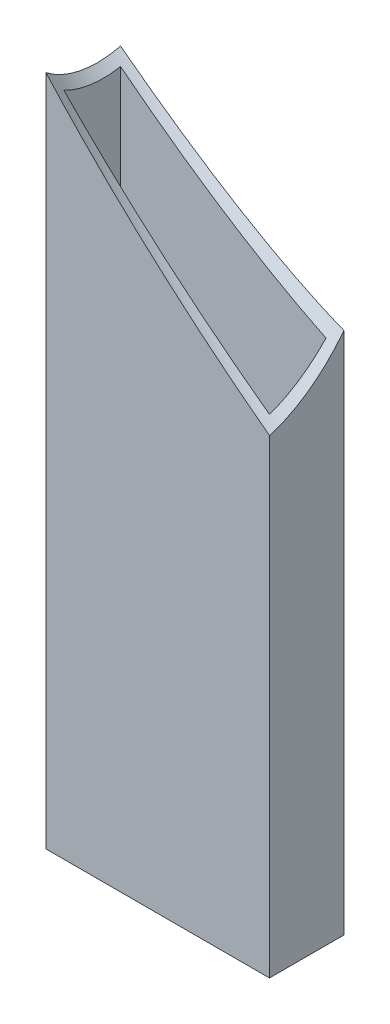
ISO-10303-21;
HEADER;
FILE_DESCRIPTION(('STEP AP214'),'2;1');
FILE_NAME('part.step','',(''),(''),'','','');
FILE_SCHEMA(('AUTOMOTIVE_DESIGN { 1 0 10303 214 1 1 1 1 }'));
ENDSEC;
DATA;
#1=APPLICATION_CONTEXT('core data for automotive mechanical design processes');
#2=APPLICATION_PROTOCOL_DEFINITION('international standard','automotive_design',2000,#1);
#3=PRODUCT_CONTEXT('',#1,'mechanical');
#4=PRODUCT('Part','Part','',(#3));
#5=PRODUCT_RELATED_PRODUCT_CATEGORY('part','',(#4));
#6=PRODUCT_DEFINITION_FORMATION('','',#4);
#7=PRODUCT_DEFINITION_CONTEXT('part definition',#1,'design');
#8=PRODUCT_DEFINITION('design','',#6,#7);
#9=PRODUCT_DEFINITION_SHAPE('','',#8);
#10=(LENGTH_UNIT() NAMED_UNIT(*) SI_UNIT(.MILLI.,.METRE.));
#11=(NAMED_UNIT(*) PLANE_ANGLE_UNIT() SI_UNIT($,.RADIAN.));
#12=(NAMED_UNIT(*) SI_UNIT($,.STERADIAN.) SOLID_ANGLE_UNIT());
#13=UNCERTAINTY_MEASURE_WITH_UNIT(LENGTH_MEASURE(1.E-05),#10,'distance_accuracy_value','');
#14=(GEOMETRIC_REPRESENTATION_CONTEXT(3) GLOBAL_UNCERTAINTY_ASSIGNED_CONTEXT((#13)) GLOBAL_UNIT_ASSIGNED_CONTEXT((#10,
#11,#12)) REPRESENTATION_CONTEXT('',''));
#15=CARTESIAN_POINT('',(0.,0.,0.));
#16=DIRECTION('',(0.,0.,1.));
#17=DIRECTION('',(1.,0.,0.));
#18=AXIS2_PLACEMENT_3D('',#15,#16,#17);
#19=CARTESIAN_POINT('',(0.,0.,0.));
#20=DIRECTION('',(0.,1.,0.));
#21=DIRECTION('',(0.,0.,1.));
#22=AXIS2_PLACEMENT_3D('',#19,#20,#21);
#23=PLANE('',#22);
#24=DIRECTION('',(0.,0.,1.));
#25=VECTOR('',#24,1.);
#26=CARTESIAN_POINT('',(-38.1,0.,-12.7));
#27=LINE('',#26,#25);
#28=CARTESIAN_POINT('',(-38.1,0.,-12.7));
#29=VERTEX_POINT('',#28);
#30=CARTESIAN_POINT('',(-38.1,0.,12.7));
#31=VERTEX_POINT('',#30);
#32=EDGE_CURVE('E125',#29,#31,#27,.T.);
#33=ORIENTED_EDGE('',*,*,#32,.F.);
#34=DIRECTION('',(-1.,0.,0.));
#35=VECTOR('',#34,1.);
#36=CARTESIAN_POINT('',(-38.1,0.,-12.7));
#37=LINE('',#36,#35);
#38=CARTESIAN_POINT('',(38.1,0.,-12.7));
#39=VERTEX_POINT('',#38);
#40=EDGE_CURVE('E134',#39,#29,#37,.T.);
#41=ORIENTED_EDGE('',*,*,#40,.F.);
#42=DIRECTION('',(0.,0.,-1.));
#43=VECTOR('',#42,1.);
#44=CARTESIAN_POINT('',(38.1,0.,-12.7));
#45=LINE('',#44,#43);
#46=CARTESIAN_POINT('',(38.1,0.,12.7));
#47=VERTEX_POINT('',#46);
#48=EDGE_CURVE('E131',#47,#39,#45,.T.);
#49=ORIENTED_EDGE('',*,*,#48,.F.);
#50=DIRECTION('',(1.,0.,0.));
#51=VECTOR('',#50,1.);
#52=CARTESIAN_POINT('',(-38.1,0.,12.7));
#53=LINE('',#52,#51);
#54=EDGE_CURVE('E128',#31,#47,#53,.T.);
#55=ORIENTED_EDGE('',*,*,#54,.F.);
#56=EDGE_LOOP('',(#33,#41,#49,#55));
#57=FACE_BOUND('',#56,.T.);
#58=DIRECTION('',(0.,0.,1.));
#59=VECTOR('',#58,1.);
#60=CARTESIAN_POINT('',(-35.052,0.,-9.65199999999999));
#61=LINE('',#60,#59);
#62=CARTESIAN_POINT('',(-35.052,0.,-9.65199999999999));
#63=VERTEX_POINT('',#62);
#64=CARTESIAN_POINT('',(-35.052,0.,9.652));
#65=VERTEX_POINT('',#64);
#66=EDGE_CURVE('E170',#63,#65,#61,.T.);
#67=ORIENTED_EDGE('',*,*,#66,.T.);
#68=DIRECTION('',(1.,0.,0.));
#69=VECTOR('',#68,1.);
#70=CARTESIAN_POINT('',(-35.052,0.,9.652));
#71=LINE('',#70,#69);
#72=CARTESIAN_POINT('',(35.052,0.,9.65199999999999));
#73=VERTEX_POINT('',#72);
#74=EDGE_CURVE('E173',#65,#73,#71,.T.);
#75=ORIENTED_EDGE('',*,*,#74,.T.);
#76=DIRECTION('',(0.,0.,-1.));
#77=VECTOR('',#76,1.);
#78=CARTESIAN_POINT('',(35.052,0.,-9.652));
#79=LINE('',#78,#77);
#80=CARTESIAN_POINT('',(35.052,0.,-9.652));
#81=VERTEX_POINT('',#80);
#82=EDGE_CURVE('E176',#73,#81,#79,.T.);
#83=ORIENTED_EDGE('',*,*,#82,.T.);
#84=DIRECTION('',(-1.,0.,0.));
#85=VECTOR('',#84,1.);
#86=CARTESIAN_POINT('',(-35.052,0.,-9.65199999999999));
#87=LINE('',#86,#85);
#88=EDGE_CURVE('E115',#81,#63,#87,.T.);
#89=ORIENTED_EDGE('',*,*,#88,.T.);
#90=EDGE_LOOP('',(#67,#75,#83,#89));
#91=FACE_BOUND('',#90,.T.);
#92=ADVANCED_FACE('F36',(#57,#91),#23,.F.);
#93=CARTESIAN_POINT('',(-38.1,241.091915260124,-12.7));
#94=DIRECTION('',(1.,0.,0.));
#95=DIRECTION('',(0.,0.,-1.));
#96=AXIS2_PLACEMENT_3D('',#93,#94,#95);
#97=PLANE('',#96);
#98=CARTESIAN_POINT('',(-38.1,273.413813543828,-13.4309935455485));
#99=DIRECTION('',(1.,0.,0.));
#100=DIRECTION('',(0.,0.923446362363606,-0.383727528120442));
#101=AXIS2_PLACEMENT_3D('',#98,#99,#100);
#102=ELLIPSE('',#101,51.7368987888011,38.1);
#103=CARTESIAN_POINT('',(-38.1,224.433507501644,-12.7));
#104=VERTEX_POINT('',#103);
#105=CARTESIAN_POINT('',(-38.1,229.251403372283,12.7));
#106=VERTEX_POINT('',#105);
#107=EDGE_CURVE('E157',#104,#106,#102,.F.);
#108=ORIENTED_EDGE('',*,*,#107,.F.);
#109=DIRECTION('',(0.,-1.,0.));
#110=VECTOR('',#109,1.);
#111=CARTESIAN_POINT('',(-38.1,241.091915260124,-12.7));
#112=LINE('',#111,#110);
#113=EDGE_CURVE('E137',#104,#29,#112,.T.);
#114=ORIENTED_EDGE('',*,*,#113,.T.);
#115=ORIENTED_EDGE('',*,*,#32,.T.);
#116=DIRECTION('',(0.,-1.,0.));
#117=VECTOR('',#116,1.);
#118=CARTESIAN_POINT('',(-38.1,241.091915260124,12.7));
#119=LINE('',#118,#117);
#120=EDGE_CURVE('E44',#106,#31,#119,.T.);
#121=ORIENTED_EDGE('',*,*,#120,.F.);
#122=EDGE_LOOP('',(#108,#114,#115,#121));
#123=FACE_BOUND('',#122,.T.);
#124=ADVANCED_FACE('F38',(#123),#97,.F.);
#125=CARTESIAN_POINT('',(-38.1,241.091915260124,12.7));
#126=DIRECTION('',(0.,0.,-1.));
#127=DIRECTION('',(-1.,0.,0.));
#128=AXIS2_PLACEMENT_3D('',#125,#126,#127);
#129=PLANE('',#128);
#130=CARTESIAN_POINT('',(36.0263742484161,210.529164499285,12.7));
#131=DIRECTION('',(0.,0.,-1.));
#132=DIRECTION('',(-0.76256219900897,0.646914903710375,0.));
#133=AXIS2_PLACEMENT_3D('',#130,#131,#132);
#134=ELLIPSE('',#133,146.763218757306,38.1);
#135=CARTESIAN_POINT('',(38.1,160.17860199527,12.7));
#136=VERTEX_POINT('',#135);
#137=EDGE_CURVE('E149',#106,#136,#134,.F.);
#138=ORIENTED_EDGE('',*,*,#137,.F.);
#139=ORIENTED_EDGE('',*,*,#120,.T.);
#140=ORIENTED_EDGE('',*,*,#54,.T.);
#141=DIRECTION('',(0.,-1.,0.));
#142=VECTOR('',#141,1.);
#143=CARTESIAN_POINT('',(38.1,241.091915260124,12.7));
#144=LINE('',#143,#142);
#145=EDGE_CURVE('E141',#136,#47,#144,.T.);
#146=ORIENTED_EDGE('',*,*,#145,.F.);
#147=EDGE_LOOP('',(#138,#139,#140,#146));
#148=FACE_BOUND('',#147,.T.);
#149=ADVANCED_FACE('F146',(#148),#129,.F.);
#150=CARTESIAN_POINT('',(38.1,241.091915260124,-12.7));
#151=DIRECTION('',(-1.,0.,0.));
#152=DIRECTION('',(0.,0.,1.));
#153=AXIS2_PLACEMENT_3D('',#150,#151,#152);
#154=PLANE('',#153);
#155=CARTESIAN_POINT('',(38.1,208.77001697642,13.4309935455487));
#156=DIRECTION('',(-1.,0.,0.));
#157=DIRECTION('',(0.,0.923446362363606,-0.383727528120442));
#158=AXIS2_PLACEMENT_3D('',#155,#156,#157);
#159=ELLIPSE('',#158,51.7368987888011,38.1);
#160=CARTESIAN_POINT('',(38.1,178.509384553323,-12.7));
#161=VERTEX_POINT('',#160);
#162=EDGE_CURVE('E51',#136,#161,#159,.F.);
#163=ORIENTED_EDGE('',*,*,#162,.F.);
#164=ORIENTED_EDGE('',*,*,#145,.T.);
#165=ORIENTED_EDGE('',*,*,#48,.T.);
#166=DIRECTION('',(0.,-1.,0.));
#167=VECTOR('',#166,1.);
#168=CARTESIAN_POINT('',(38.1,241.091915260124,-12.7));
#169=LINE('',#168,#167);
#170=EDGE_CURVE('E139',#161,#39,#169,.T.);
#171=ORIENTED_EDGE('',*,*,#170,.F.);
#172=EDGE_LOOP('',(#163,#164,#165,#171));
#173=FACE_BOUND('',#172,.T.);
#174=ADVANCED_FACE('F163',(#173),#154,.F.);
#175=CARTESIAN_POINT('',(-38.1,241.091915260124,-12.7));
#176=DIRECTION('',(0.,0.,1.));
#177=DIRECTION('',(1.,0.,0.));
#178=AXIS2_PLACEMENT_3D('',#175,#176,#177);
#179=PLANE('',#178);
#180=CARTESIAN_POINT('',(-36.0263742484167,271.654666020963,-12.7));
#181=DIRECTION('',(0.,0.,1.));
#182=DIRECTION('',(-0.76256219900897,0.646914903710375,0.));
#183=AXIS2_PLACEMENT_3D('',#180,#181,#182);
#184=ELLIPSE('',#183,146.763218757306,38.1);
#185=EDGE_CURVE('E161',#161,#104,#184,.F.);
#186=ORIENTED_EDGE('',*,*,#185,.F.);
#187=ORIENTED_EDGE('',*,*,#170,.T.);
#188=ORIENTED_EDGE('',*,*,#40,.T.);
#189=ORIENTED_EDGE('',*,*,#113,.F.);
#190=EDGE_LOOP('',(#186,#187,#188,#189));
#191=FACE_BOUND('',#190,.T.);
#192=ADVANCED_FACE('F159',(#191),#179,.F.);
#193=CARTESIAN_POINT('',(-35.052,241.091915260124,-9.65199999999999));
#194=DIRECTION('',(1.,0.,0.));
#195=DIRECTION('',(0.,0.,-1.));
#196=AXIS2_PLACEMENT_3D('',#193,#194,#195);
#197=PLANE('',#196);
#198=DIRECTION('',(0.,-1.,0.));
#199=VECTOR('',#198,1.);
#200=CARTESIAN_POINT('',(-35.052,241.091915260124,-9.65199999999999));
#201=LINE('',#200,#199);
#202=CARTESIAN_POINT('',(-35.052,221.424273391685,-9.65199999999999));
#203=VERTEX_POINT('',#202);
#204=EDGE_CURVE('E117',#203,#63,#201,.T.);
#205=ORIENTED_EDGE('',*,*,#204,.F.);
#206=CARTESIAN_POINT('',(-35.052,270.828061681131,-12.3565140619046));
#207=DIRECTION('',(1.,0.,0.));
#208=DIRECTION('',(0.,0.923446362363606,-0.383727528120442));
#209=AXIS2_PLACEMENT_3D('',#206,#207,#208);
#210=ELLIPSE('',#209,51.7368987888011,38.1);
#211=CARTESIAN_POINT('',(-35.052,224.056630649238,9.652));
#212=VERTEX_POINT('',#211);
#213=EDGE_CURVE('E59',#203,#212,#210,.F.);
#214=ORIENTED_EDGE('',*,*,#213,.T.);
#215=DIRECTION('',(0.,-1.,0.));
#216=VECTOR('',#215,1.);
#217=CARTESIAN_POINT('',(-35.052,241.091915260124,9.652));
#218=LINE('',#217,#216);
#219=EDGE_CURVE('E119',#212,#65,#218,.T.);
#220=ORIENTED_EDGE('',*,*,#219,.T.);
#221=ORIENTED_EDGE('',*,*,#66,.F.);
#222=EDGE_LOOP('',(#205,#214,#220,#221));
#223=FACE_BOUND('',#222,.T.);
#224=ADVANCED_FACE('F184',(#223),#197,.T.);
#225=CARTESIAN_POINT('',(-35.052,241.091915260124,9.652));
#226=DIRECTION('',(0.,0.,-1.));
#227=DIRECTION('',(-1.,0.,0.));
#228=AXIS2_PLACEMENT_3D('',#225,#226,#227);
#229=PLANE('',#228);
#230=ORIENTED_EDGE('',*,*,#219,.F.);
#231=CARTESIAN_POINT('',(27.3800444287962,217.864224681887,9.652));
#232=DIRECTION('',(0.,0.,-1.));
#233=DIRECTION('',(-0.76256219900897,0.646914903710376,0.));
#234=AXIS2_PLACEMENT_3D('',#231,#232,#233);
#235=ELLIPSE('',#234,146.763218757306,38.1);
#236=CARTESIAN_POINT('',(35.052,163.390791260813,9.65199999999999));
#237=VERTEX_POINT('',#236);
#238=EDGE_CURVE('E111',#212,#237,#235,.F.);
#239=ORIENTED_EDGE('',*,*,#238,.T.);
#240=DIRECTION('',(0.,-1.,0.));
#241=VECTOR('',#240,1.);
#242=CARTESIAN_POINT('',(35.052,241.091915260124,9.65199999999999));
#243=LINE('',#242,#241);
#244=EDGE_CURVE('E110',#237,#73,#243,.T.);
#245=ORIENTED_EDGE('',*,*,#244,.T.);
#246=ORIENTED_EDGE('',*,*,#74,.F.);
#247=EDGE_LOOP('',(#230,#239,#245,#246));
#248=FACE_BOUND('',#247,.T.);
#249=ADVANCED_FACE('F181',(#248),#229,.T.);
#250=CARTESIAN_POINT('',(35.052,241.091915260124,-9.652));
#251=DIRECTION('',(-1.,0.,0.));
#252=DIRECTION('',(0.,0.,1.));
#253=AXIS2_PLACEMENT_3D('',#250,#251,#252);
#254=PLANE('',#253);
#255=ORIENTED_EDGE('',*,*,#244,.F.);
#256=CARTESIAN_POINT('',(35.052,211.355768839117,12.3565140619048));
#257=DIRECTION('',(-1.,0.,0.));
#258=DIRECTION('',(0.,0.923446362363606,-0.383727528120442));
#259=AXIS2_PLACEMENT_3D('',#256,#257,#258);
#260=ELLIPSE('',#259,51.7368987888011,38.1);
#261=CARTESIAN_POINT('',(35.052,176.292942400802,-9.652));
#262=VERTEX_POINT('',#261);
#263=EDGE_CURVE('E99',#237,#262,#260,.F.);
#264=ORIENTED_EDGE('',*,*,#263,.T.);
#265=DIRECTION('',(0.,-1.,0.));
#266=VECTOR('',#265,1.);
#267=CARTESIAN_POINT('',(35.052,241.091915260124,-9.652));
#268=LINE('',#267,#266);
#269=EDGE_CURVE('E108',#262,#81,#268,.T.);
#270=ORIENTED_EDGE('',*,*,#269,.T.);
#271=ORIENTED_EDGE('',*,*,#82,.F.);
#272=EDGE_LOOP('',(#255,#264,#270,#271));
#273=FACE_BOUND('',#272,.T.);
#274=ADVANCED_FACE('F106',(#273),#254,.T.);
#275=CARTESIAN_POINT('',(-35.052,241.091915260124,-9.65199999999999));
#276=DIRECTION('',(0.,0.,1.));
#277=DIRECTION('',(1.,0.,0.));
#278=AXIS2_PLACEMENT_3D('',#275,#276,#277);
#279=PLANE('',#278);
#280=ORIENTED_EDGE('',*,*,#269,.F.);
#281=CARTESIAN_POINT('',(-27.3800444287967,264.319605838361,-9.65199999999998));
#282=DIRECTION('',(0.,0.,1.));
#283=DIRECTION('',(-0.76256219900897,0.646914903710376,0.));
#284=AXIS2_PLACEMENT_3D('',#281,#282,#283);
#285=ELLIPSE('',#284,146.763218757306,38.1);
#286=EDGE_CURVE('E11',#262,#203,#285,.F.);
#287=ORIENTED_EDGE('',*,*,#286,.T.);
#288=ORIENTED_EDGE('',*,*,#204,.T.);
#289=ORIENTED_EDGE('',*,*,#88,.F.);
#290=EDGE_LOOP('',(#280,#287,#288,#289));
#291=FACE_BOUND('',#290,.T.);
#292=ADVANCED_FACE('F113',(#291),#279,.T.);
#293=CARTESIAN_POINT('',(84.9147816726554,169.054987805886,29.9341177051735));
#294=DIRECTION('',(-0.736418318297946,0.624735904941793,-0.259601828868333));
#295=DIRECTION('',(-0.646914903710375,-0.76256219900897,0.));
#296=AXIS2_PLACEMENT_3D('',#293,#294,#295);
#297=CYLINDRICAL_SURFACE('',#296,38.1);
#298=ORIENTED_EDGE('',*,*,#286,.F.);
#299=ORIENTED_EDGE('',*,*,#263,.F.);
#300=ORIENTED_EDGE('',*,*,#238,.F.);
#301=ORIENTED_EDGE('',*,*,#213,.F.);
#302=EDGE_LOOP('',(#298,#299,#300,#301));
#303=FACE_BOUND('',#302,.T.);
#304=ORIENTED_EDGE('',*,*,#107,.T.);
#305=ORIENTED_EDGE('',*,*,#137,.T.);
#306=ORIENTED_EDGE('',*,*,#162,.T.);
#307=ORIENTED_EDGE('',*,*,#185,.T.);
#308=EDGE_LOOP('',(#304,#305,#306,#307));
#309=FACE_BOUND('',#308,.T.);
#310=ADVANCED_FACE('F98',(#303,#309),#297,.F.);
#311=CLOSED_SHELL('',(#92,#124,#149,#174,#192,#224,#249,#274,#292,#310));
#312=MANIFOLD_SOLID_BREP('B2',#311);
#313=ADVANCED_BREP_SHAPE_REPRESENTATION('',(#18,#312),#14);
#314=SHAPE_DEFINITION_REPRESENTATION(#9,#313);
ENDSEC;
END-ISO-10303-21;
